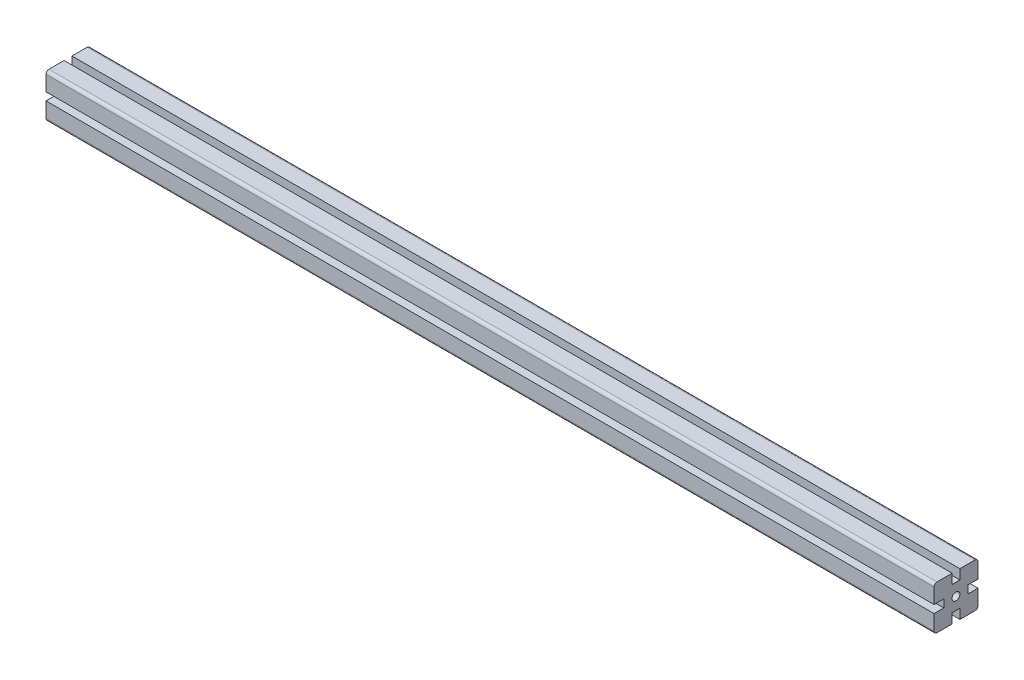
ISO-10303-21;
HEADER;
FILE_DESCRIPTION(('STEP AP214'),'2;1');
FILE_NAME('part.step','',(''),(''),'','','');
FILE_SCHEMA(('AUTOMOTIVE_DESIGN { 1 0 10303 214 1 1 1 1 }'));
ENDSEC;
DATA;
#1=APPLICATION_CONTEXT('core data for automotive mechanical design processes');
#2=APPLICATION_PROTOCOL_DEFINITION('international standard','automotive_design',2000,#1);
#3=PRODUCT_CONTEXT('',#1,'mechanical');
#4=PRODUCT('Part','Part','',(#3));
#5=PRODUCT_RELATED_PRODUCT_CATEGORY('part','',(#4));
#6=PRODUCT_DEFINITION_FORMATION('','',#4);
#7=PRODUCT_DEFINITION_CONTEXT('part definition',#1,'design');
#8=PRODUCT_DEFINITION('design','',#6,#7);
#9=PRODUCT_DEFINITION_SHAPE('','',#8);
#10=(LENGTH_UNIT() NAMED_UNIT(*) SI_UNIT(.MILLI.,.METRE.));
#11=(NAMED_UNIT(*) PLANE_ANGLE_UNIT() SI_UNIT($,.RADIAN.));
#12=(NAMED_UNIT(*) SI_UNIT($,.STERADIAN.) SOLID_ANGLE_UNIT());
#13=UNCERTAINTY_MEASURE_WITH_UNIT(LENGTH_MEASURE(1.E-05),#10,'distance_accuracy_value','');
#14=(GEOMETRIC_REPRESENTATION_CONTEXT(3) GLOBAL_UNCERTAINTY_ASSIGNED_CONTEXT((#13)) GLOBAL_UNIT_ASSIGNED_CONTEXT((#10,
#11,#12)) REPRESENTATION_CONTEXT('',''));
#15=CARTESIAN_POINT('',(0.,0.,0.));
#16=DIRECTION('',(0.,0.,1.));
#17=DIRECTION('',(1.,0.,0.));
#18=AXIS2_PLACEMENT_3D('',#15,#16,#17);
#19=CARTESIAN_POINT('',(92.,-22.5,-22.5));
#20=DIRECTION('',(0.,0.,-1.));
#21=DIRECTION('',(0.,1.,0.));
#22=AXIS2_PLACEMENT_3D('',#19,#20,#21);
#23=PLANE('',#22);
#24=DIRECTION('',(0.,1.,0.));
#25=VECTOR('',#24,1.);
#26=CARTESIAN_POINT('',(1000.,-22.5,-22.5));
#27=LINE('',#26,#25);
#28=CARTESIAN_POINT('',(1000.,-19.5,-22.5));
#29=VERTEX_POINT('',#28);
#30=CARTESIAN_POINT('',(1000.,-4.,-22.5));
#31=VERTEX_POINT('',#30);
#32=EDGE_CURVE('E270',#29,#31,#27,.T.);
#33=ORIENTED_EDGE('',*,*,#32,.F.);
#34=DIRECTION('',(1.,0.,0.));
#35=VECTOR('',#34,1.);
#36=CARTESIAN_POINT('',(92.,-19.5,-22.5));
#37=LINE('',#36,#35);
#38=CARTESIAN_POINT('',(92.,-19.5,-22.5));
#39=VERTEX_POINT('',#38);
#40=EDGE_CURVE('E200',#29,#39,#37,.F.);
#41=ORIENTED_EDGE('',*,*,#40,.T.);
#42=DIRECTION('',(0.,1.,0.));
#43=VECTOR('',#42,1.);
#44=CARTESIAN_POINT('',(92.,-22.5,-22.5));
#45=LINE('',#44,#43);
#46=CARTESIAN_POINT('',(92.,-4.,-22.5));
#47=VERTEX_POINT('',#46);
#48=EDGE_CURVE('E194',#39,#47,#45,.T.);
#49=ORIENTED_EDGE('',*,*,#48,.T.);
#50=DIRECTION('',(1.,0.,0.));
#51=VECTOR('',#50,1.);
#52=CARTESIAN_POINT('',(92.,-4.,-22.5));
#53=LINE('',#52,#51);
#54=EDGE_CURVE('E197',#47,#31,#53,.T.);
#55=ORIENTED_EDGE('',*,*,#54,.T.);
#56=EDGE_LOOP('',(#33,#41,#49,#55));
#57=FACE_BOUND('',#56,.T.);
#58=ADVANCED_FACE('F33',(#57),#23,.T.);
#59=CARTESIAN_POINT('',(92.,-22.5,-4.));
#60=DIRECTION('',(0.,-1.,0.));
#61=DIRECTION('',(0.,0.,-1.));
#62=AXIS2_PLACEMENT_3D('',#59,#60,#61);
#63=PLANE('',#62);
#64=DIRECTION('',(0.,0.,-1.));
#65=VECTOR('',#64,1.);
#66=CARTESIAN_POINT('',(92.,-22.5,-4.));
#67=LINE('',#66,#65);
#68=CARTESIAN_POINT('',(92.,-22.5,-4.));
#69=VERTEX_POINT('',#68);
#70=CARTESIAN_POINT('',(92.,-22.5,-19.5));
#71=VERTEX_POINT('',#70);
#72=EDGE_CURVE('E212',#69,#71,#67,.T.);
#73=ORIENTED_EDGE('',*,*,#72,.T.);
#74=DIRECTION('',(1.,0.,0.));
#75=VECTOR('',#74,1.);
#76=CARTESIAN_POINT('',(92.,-22.5,-19.5));
#77=LINE('',#76,#75);
#78=CARTESIAN_POINT('',(1000.,-22.5,-19.5));
#79=VERTEX_POINT('',#78);
#80=EDGE_CURVE('E376',#71,#79,#77,.T.);
#81=ORIENTED_EDGE('',*,*,#80,.T.);
#82=DIRECTION('',(0.,0.,-1.));
#83=VECTOR('',#82,1.);
#84=CARTESIAN_POINT('',(1000.,-22.5,-4.));
#85=LINE('',#84,#83);
#86=CARTESIAN_POINT('',(1000.,-22.5,-4.));
#87=VERTEX_POINT('',#86);
#88=EDGE_CURVE('E204',#87,#79,#85,.T.);
#89=ORIENTED_EDGE('',*,*,#88,.F.);
#90=DIRECTION('',(1.,0.,0.));
#91=VECTOR('',#90,1.);
#92=CARTESIAN_POINT('',(92.,-22.5,-4.));
#93=LINE('',#92,#91);
#94=EDGE_CURVE('E324',#69,#87,#93,.T.);
#95=ORIENTED_EDGE('',*,*,#94,.F.);
#96=EDGE_LOOP('',(#73,#81,#89,#95));
#97=FACE_BOUND('',#96,.T.);
#98=ADVANCED_FACE('F404',(#97),#63,.T.);
#99=CARTESIAN_POINT('',(92.,-12.5,-4.));
#100=DIRECTION('',(0.,0.,1.));
#101=DIRECTION('',(1.,0.,0.));
#102=AXIS2_PLACEMENT_3D('',#99,#100,#101);
#103=PLANE('',#102);
#104=DIRECTION('',(0.,-1.,0.));
#105=VECTOR('',#104,1.);
#106=CARTESIAN_POINT('',(1000.,-12.5,-4.));
#107=LINE('',#106,#105);
#108=CARTESIAN_POINT('',(1000.,-12.5,-4.));
#109=VERTEX_POINT('',#108);
#110=EDGE_CURVE('E319',#109,#87,#107,.T.);
#111=ORIENTED_EDGE('',*,*,#110,.F.);
#112=DIRECTION('',(1.,0.,0.));
#113=VECTOR('',#112,1.);
#114=CARTESIAN_POINT('',(92.,-12.5,-4.));
#115=LINE('',#114,#113);
#116=CARTESIAN_POINT('',(92.,-12.5,-4.));
#117=VERTEX_POINT('',#116);
#118=EDGE_CURVE('E327',#117,#109,#115,.T.);
#119=ORIENTED_EDGE('',*,*,#118,.F.);
#120=DIRECTION('',(0.,-1.,0.));
#121=VECTOR('',#120,1.);
#122=CARTESIAN_POINT('',(92.,-12.5,-4.));
#123=LINE('',#122,#121);
#124=EDGE_CURVE('E265',#117,#69,#123,.T.);
#125=ORIENTED_EDGE('',*,*,#124,.T.);
#126=ORIENTED_EDGE('',*,*,#94,.T.);
#127=EDGE_LOOP('',(#111,#119,#125,#126));
#128=FACE_BOUND('',#127,.T.);
#129=ADVANCED_FACE('F408',(#128),#103,.T.);
#130=CARTESIAN_POINT('',(92.,-12.5,4.));
#131=DIRECTION('',(0.,-1.,0.));
#132=DIRECTION('',(0.,0.,-1.));
#133=AXIS2_PLACEMENT_3D('',#130,#131,#132);
#134=PLANE('',#133);
#135=DIRECTION('',(0.,0.,-1.));
#136=VECTOR('',#135,1.);
#137=CARTESIAN_POINT('',(1000.,-12.5,4.));
#138=LINE('',#137,#136);
#139=CARTESIAN_POINT('',(1000.,-12.5,4.));
#140=VERTEX_POINT('',#139);
#141=EDGE_CURVE('E316',#140,#109,#138,.T.);
#142=ORIENTED_EDGE('',*,*,#141,.F.);
#143=DIRECTION('',(1.,0.,0.));
#144=VECTOR('',#143,1.);
#145=CARTESIAN_POINT('',(92.,-12.5,4.));
#146=LINE('',#145,#144);
#147=CARTESIAN_POINT('',(92.,-12.5,4.));
#148=VERTEX_POINT('',#147);
#149=EDGE_CURVE('E329',#148,#140,#146,.T.);
#150=ORIENTED_EDGE('',*,*,#149,.F.);
#151=DIRECTION('',(0.,0.,-1.));
#152=VECTOR('',#151,1.);
#153=CARTESIAN_POINT('',(92.,-12.5,4.));
#154=LINE('',#153,#152);
#155=EDGE_CURVE('E262',#148,#117,#154,.T.);
#156=ORIENTED_EDGE('',*,*,#155,.T.);
#157=ORIENTED_EDGE('',*,*,#118,.T.);
#158=EDGE_LOOP('',(#142,#150,#156,#157));
#159=FACE_BOUND('',#158,.T.);
#160=ADVANCED_FACE('F413',(#159),#134,.T.);
#161=CARTESIAN_POINT('',(92.,-22.5,4.));
#162=DIRECTION('',(0.,0.,-1.));
#163=DIRECTION('',(-1.,0.,0.));
#164=AXIS2_PLACEMENT_3D('',#161,#162,#163);
#165=PLANE('',#164);
#166=DIRECTION('',(0.,1.,0.));
#167=VECTOR('',#166,1.);
#168=CARTESIAN_POINT('',(1000.,-22.5,4.));
#169=LINE('',#168,#167);
#170=CARTESIAN_POINT('',(1000.,-22.5,4.));
#171=VERTEX_POINT('',#170);
#172=EDGE_CURVE('E313',#171,#140,#169,.T.);
#173=ORIENTED_EDGE('',*,*,#172,.F.);
#174=DIRECTION('',(1.,0.,0.));
#175=VECTOR('',#174,1.);
#176=CARTESIAN_POINT('',(92.,-22.5,4.));
#177=LINE('',#176,#175);
#178=CARTESIAN_POINT('',(92.,-22.5,4.));
#179=VERTEX_POINT('',#178);
#180=EDGE_CURVE('E331',#179,#171,#177,.T.);
#181=ORIENTED_EDGE('',*,*,#180,.F.);
#182=DIRECTION('',(0.,1.,0.));
#183=VECTOR('',#182,1.);
#184=CARTESIAN_POINT('',(92.,-22.5,4.));
#185=LINE('',#184,#183);
#186=EDGE_CURVE('E259',#179,#148,#185,.T.);
#187=ORIENTED_EDGE('',*,*,#186,.T.);
#188=ORIENTED_EDGE('',*,*,#149,.T.);
#189=EDGE_LOOP('',(#173,#181,#187,#188));
#190=FACE_BOUND('',#189,.T.);
#191=ADVANCED_FACE('F416',(#190),#165,.T.);
#192=CARTESIAN_POINT('',(92.,-22.5,22.5));
#193=DIRECTION('',(0.,-1.,0.));
#194=DIRECTION('',(0.,0.,-1.));
#195=AXIS2_PLACEMENT_3D('',#192,#193,#194);
#196=PLANE('',#195);
#197=DIRECTION('',(0.,0.,-1.));
#198=VECTOR('',#197,1.);
#199=CARTESIAN_POINT('',(1000.,-22.5,22.5));
#200=LINE('',#199,#198);
#201=CARTESIAN_POINT('',(1000.,-22.5,19.5));
#202=VERTEX_POINT('',#201);
#203=EDGE_CURVE('E311',#202,#171,#200,.T.);
#204=ORIENTED_EDGE('',*,*,#203,.F.);
#205=DIRECTION('',(1.,0.,0.));
#206=VECTOR('',#205,1.);
#207=CARTESIAN_POINT('',(92.,-22.5,19.5));
#208=LINE('',#207,#206);
#209=CARTESIAN_POINT('',(92.,-22.5,19.5));
#210=VERTEX_POINT('',#209);
#211=EDGE_CURVE('E367',#202,#210,#208,.F.);
#212=ORIENTED_EDGE('',*,*,#211,.T.);
#213=DIRECTION('',(0.,0.,-1.));
#214=VECTOR('',#213,1.);
#215=CARTESIAN_POINT('',(92.,-22.5,22.5));
#216=LINE('',#215,#214);
#217=EDGE_CURVE('E257',#210,#179,#216,.T.);
#218=ORIENTED_EDGE('',*,*,#217,.T.);
#219=ORIENTED_EDGE('',*,*,#180,.T.);
#220=EDGE_LOOP('',(#204,#212,#218,#219));
#221=FACE_BOUND('',#220,.T.);
#222=ADVANCED_FACE('F628',(#221),#196,.T.);
#223=CARTESIAN_POINT('',(92.,-4.,22.5));
#224=DIRECTION('',(0.,0.,1.));
#225=DIRECTION('',(0.,-1.,0.));
#226=AXIS2_PLACEMENT_3D('',#223,#224,#225);
#227=PLANE('',#226);
#228=DIRECTION('',(0.,-1.,0.));
#229=VECTOR('',#228,1.);
#230=CARTESIAN_POINT('',(92.,-4.,22.5));
#231=LINE('',#230,#229);
#232=CARTESIAN_POINT('',(92.,-4.,22.5));
#233=VERTEX_POINT('',#232);
#234=CARTESIAN_POINT('',(92.,-19.5,22.5));
#235=VERTEX_POINT('',#234);
#236=EDGE_CURVE('E254',#233,#235,#231,.T.);
#237=ORIENTED_EDGE('',*,*,#236,.T.);
#238=DIRECTION('',(1.,0.,0.));
#239=VECTOR('',#238,1.);
#240=CARTESIAN_POINT('',(92.,-19.5,22.5));
#241=LINE('',#240,#239);
#242=CARTESIAN_POINT('',(1000.,-19.5,22.5));
#243=VERTEX_POINT('',#242);
#244=EDGE_CURVE('E326',#235,#243,#241,.T.);
#245=ORIENTED_EDGE('',*,*,#244,.T.);
#246=DIRECTION('',(0.,-1.,0.));
#247=VECTOR('',#246,1.);
#248=CARTESIAN_POINT('',(1000.,-4.,22.5));
#249=LINE('',#248,#247);
#250=CARTESIAN_POINT('',(1000.,-4.,22.5));
#251=VERTEX_POINT('',#250);
#252=EDGE_CURVE('E308',#251,#243,#249,.T.);
#253=ORIENTED_EDGE('',*,*,#252,.F.);
#254=DIRECTION('',(1.,0.,0.));
#255=VECTOR('',#254,1.);
#256=CARTESIAN_POINT('',(92.,-4.,22.5));
#257=LINE('',#256,#255);
#258=EDGE_CURVE('E334',#233,#251,#257,.T.);
#259=ORIENTED_EDGE('',*,*,#258,.F.);
#260=EDGE_LOOP('',(#237,#245,#253,#259));
#261=FACE_BOUND('',#260,.T.);
#262=ADVANCED_FACE('F427',(#261),#227,.T.);
#263=CARTESIAN_POINT('',(92.,-4.,12.5));
#264=DIRECTION('',(0.,1.,0.));
#265=DIRECTION('',(0.,0.,1.));
#266=AXIS2_PLACEMENT_3D('',#263,#264,#265);
#267=PLANE('',#266);
#268=DIRECTION('',(0.,0.,1.));
#269=VECTOR('',#268,1.);
#270=CARTESIAN_POINT('',(1000.,-4.,12.5));
#271=LINE('',#270,#269);
#272=CARTESIAN_POINT('',(1000.,-4.,12.5));
#273=VERTEX_POINT('',#272);
#274=EDGE_CURVE('E305',#273,#251,#271,.T.);
#275=ORIENTED_EDGE('',*,*,#274,.F.);
#276=DIRECTION('',(1.,0.,0.));
#277=VECTOR('',#276,1.);
#278=CARTESIAN_POINT('',(92.,-4.,12.5));
#279=LINE('',#278,#277);
#280=CARTESIAN_POINT('',(92.,-4.,12.5));
#281=VERTEX_POINT('',#280);
#282=EDGE_CURVE('E336',#281,#273,#279,.T.);
#283=ORIENTED_EDGE('',*,*,#282,.F.);
#284=DIRECTION('',(0.,0.,1.));
#285=VECTOR('',#284,1.);
#286=CARTESIAN_POINT('',(92.,-4.,12.5));
#287=LINE('',#286,#285);
#288=EDGE_CURVE('E251',#281,#233,#287,.T.);
#289=ORIENTED_EDGE('',*,*,#288,.T.);
#290=ORIENTED_EDGE('',*,*,#258,.T.);
#291=EDGE_LOOP('',(#275,#283,#289,#290));
#292=FACE_BOUND('',#291,.T.);
#293=ADVANCED_FACE('F432',(#292),#267,.T.);
#294=CARTESIAN_POINT('',(92.,4.,12.5));
#295=DIRECTION('',(0.,0.,1.));
#296=DIRECTION('',(1.,0.,0.));
#297=AXIS2_PLACEMENT_3D('',#294,#295,#296);
#298=PLANE('',#297);
#299=DIRECTION('',(0.,-1.,0.));
#300=VECTOR('',#299,1.);
#301=CARTESIAN_POINT('',(1000.,4.,12.5));
#302=LINE('',#301,#300);
#303=CARTESIAN_POINT('',(1000.,4.,12.5));
#304=VERTEX_POINT('',#303);
#305=EDGE_CURVE('E302',#304,#273,#302,.T.);
#306=ORIENTED_EDGE('',*,*,#305,.F.);
#307=DIRECTION('',(1.,0.,0.));
#308=VECTOR('',#307,1.);
#309=CARTESIAN_POINT('',(92.,4.,12.5));
#310=LINE('',#309,#308);
#311=CARTESIAN_POINT('',(92.,4.,12.5));
#312=VERTEX_POINT('',#311);
#313=EDGE_CURVE('E338',#312,#304,#310,.T.);
#314=ORIENTED_EDGE('',*,*,#313,.F.);
#315=DIRECTION('',(0.,-1.,0.));
#316=VECTOR('',#315,1.);
#317=CARTESIAN_POINT('',(92.,4.,12.5));
#318=LINE('',#317,#316);
#319=EDGE_CURVE('E248',#312,#281,#318,.T.);
#320=ORIENTED_EDGE('',*,*,#319,.T.);
#321=ORIENTED_EDGE('',*,*,#282,.T.);
#322=EDGE_LOOP('',(#306,#314,#320,#321));
#323=FACE_BOUND('',#322,.T.);
#324=ADVANCED_FACE('F437',(#323),#298,.T.);
#325=CARTESIAN_POINT('',(92.,4.,22.5));
#326=DIRECTION('',(0.,-1.,0.));
#327=DIRECTION('',(0.,0.,-1.));
#328=AXIS2_PLACEMENT_3D('',#325,#326,#327);
#329=PLANE('',#328);
#330=DIRECTION('',(0.,0.,-1.));
#331=VECTOR('',#330,1.);
#332=CARTESIAN_POINT('',(1000.,4.,22.5));
#333=LINE('',#332,#331);
#334=CARTESIAN_POINT('',(1000.,4.,22.5));
#335=VERTEX_POINT('',#334);
#336=EDGE_CURVE('E299',#335,#304,#333,.T.);
#337=ORIENTED_EDGE('',*,*,#336,.F.);
#338=DIRECTION('',(1.,0.,0.));
#339=VECTOR('',#338,1.);
#340=CARTESIAN_POINT('',(92.,4.,22.5));
#341=LINE('',#340,#339);
#342=CARTESIAN_POINT('',(92.,4.,22.5));
#343=VERTEX_POINT('',#342);
#344=EDGE_CURVE('E340',#343,#335,#341,.T.);
#345=ORIENTED_EDGE('',*,*,#344,.F.);
#346=DIRECTION('',(0.,0.,-1.));
#347=VECTOR('',#346,1.);
#348=CARTESIAN_POINT('',(92.,4.,22.5));
#349=LINE('',#348,#347);
#350=EDGE_CURVE('E245',#343,#312,#349,.T.);
#351=ORIENTED_EDGE('',*,*,#350,.T.);
#352=ORIENTED_EDGE('',*,*,#313,.T.);
#353=EDGE_LOOP('',(#337,#345,#351,#352));
#354=FACE_BOUND('',#353,.T.);
#355=ADVANCED_FACE('F440',(#354),#329,.T.);
#356=CARTESIAN_POINT('',(92.,22.5,22.5));
#357=DIRECTION('',(0.,0.,1.));
#358=DIRECTION('',(0.,-1.,0.));
#359=AXIS2_PLACEMENT_3D('',#356,#357,#358);
#360=PLANE('',#359);
#361=DIRECTION('',(0.,-1.,0.));
#362=VECTOR('',#361,1.);
#363=CARTESIAN_POINT('',(1000.,22.5,22.5));
#364=LINE('',#363,#362);
#365=CARTESIAN_POINT('',(1000.,19.5,22.5));
#366=VERTEX_POINT('',#365);
#367=EDGE_CURVE('E297',#366,#335,#364,.T.);
#368=ORIENTED_EDGE('',*,*,#367,.F.);
#369=DIRECTION('',(1.,0.,0.));
#370=VECTOR('',#369,1.);
#371=CARTESIAN_POINT('',(92.,19.5,22.5));
#372=LINE('',#371,#370);
#373=CARTESIAN_POINT('',(92.,19.5,22.5));
#374=VERTEX_POINT('',#373);
#375=EDGE_CURVE('E383',#366,#374,#372,.F.);
#376=ORIENTED_EDGE('',*,*,#375,.T.);
#377=DIRECTION('',(0.,-1.,0.));
#378=VECTOR('',#377,1.);
#379=CARTESIAN_POINT('',(92.,22.5,22.5));
#380=LINE('',#379,#378);
#381=EDGE_CURVE('E243',#374,#343,#380,.T.);
#382=ORIENTED_EDGE('',*,*,#381,.T.);
#383=ORIENTED_EDGE('',*,*,#344,.T.);
#384=EDGE_LOOP('',(#368,#376,#382,#383));
#385=FACE_BOUND('',#384,.T.);
#386=ADVANCED_FACE('F592',(#385),#360,.T.);
#387=CARTESIAN_POINT('',(92.,22.5,4.));
#388=DIRECTION('',(0.,1.,0.));
#389=DIRECTION('',(0.,0.,1.));
#390=AXIS2_PLACEMENT_3D('',#387,#388,#389);
#391=PLANE('',#390);
#392=DIRECTION('',(0.,0.,1.));
#393=VECTOR('',#392,1.);
#394=CARTESIAN_POINT('',(92.,22.5,4.));
#395=LINE('',#394,#393);
#396=CARTESIAN_POINT('',(92.,22.5,4.));
#397=VERTEX_POINT('',#396);
#398=CARTESIAN_POINT('',(92.,22.5,19.5));
#399=VERTEX_POINT('',#398);
#400=EDGE_CURVE('E240',#397,#399,#395,.T.);
#401=ORIENTED_EDGE('',*,*,#400,.T.);
#402=DIRECTION('',(1.,0.,0.));
#403=VECTOR('',#402,1.);
#404=CARTESIAN_POINT('',(92.,22.5,19.5));
#405=LINE('',#404,#403);
#406=CARTESIAN_POINT('',(1000.,22.5,19.5));
#407=VERTEX_POINT('',#406);
#408=EDGE_CURVE('E380',#399,#407,#405,.T.);
#409=ORIENTED_EDGE('',*,*,#408,.T.);
#410=DIRECTION('',(0.,0.,1.));
#411=VECTOR('',#410,1.);
#412=CARTESIAN_POINT('',(1000.,22.5,4.));
#413=LINE('',#412,#411);
#414=CARTESIAN_POINT('',(1000.,22.5,4.));
#415=VERTEX_POINT('',#414);
#416=EDGE_CURVE('E294',#415,#407,#413,.T.);
#417=ORIENTED_EDGE('',*,*,#416,.F.);
#418=DIRECTION('',(1.,0.,0.));
#419=VECTOR('',#418,1.);
#420=CARTESIAN_POINT('',(92.,22.5,4.));
#421=LINE('',#420,#419);
#422=EDGE_CURVE('E343',#397,#415,#421,.T.);
#423=ORIENTED_EDGE('',*,*,#422,.F.);
#424=EDGE_LOOP('',(#401,#409,#417,#423));
#425=FACE_BOUND('',#424,.T.);
#426=ADVANCED_FACE('F452',(#425),#391,.T.);
#427=CARTESIAN_POINT('',(92.,12.5,4.));
#428=DIRECTION('',(0.,0.,-1.));
#429=DIRECTION('',(-1.,0.,0.));
#430=AXIS2_PLACEMENT_3D('',#427,#428,#429);
#431=PLANE('',#430);
#432=DIRECTION('',(0.,1.,0.));
#433=VECTOR('',#432,1.);
#434=CARTESIAN_POINT('',(1000.,12.5,4.));
#435=LINE('',#434,#433);
#436=CARTESIAN_POINT('',(1000.,12.5,4.));
#437=VERTEX_POINT('',#436);
#438=EDGE_CURVE('E291',#437,#415,#435,.T.);
#439=ORIENTED_EDGE('',*,*,#438,.F.);
#440=DIRECTION('',(1.,0.,0.));
#441=VECTOR('',#440,1.);
#442=CARTESIAN_POINT('',(92.,12.5,4.));
#443=LINE('',#442,#441);
#444=CARTESIAN_POINT('',(92.,12.5,4.));
#445=VERTEX_POINT('',#444);
#446=EDGE_CURVE('E345',#445,#437,#443,.T.);
#447=ORIENTED_EDGE('',*,*,#446,.F.);
#448=DIRECTION('',(0.,1.,0.));
#449=VECTOR('',#448,1.);
#450=CARTESIAN_POINT('',(92.,12.5,4.));
#451=LINE('',#450,#449);
#452=EDGE_CURVE('E237',#445,#397,#451,.T.);
#453=ORIENTED_EDGE('',*,*,#452,.T.);
#454=ORIENTED_EDGE('',*,*,#422,.T.);
#455=EDGE_LOOP('',(#439,#447,#453,#454));
#456=FACE_BOUND('',#455,.T.);
#457=ADVANCED_FACE('F457',(#456),#431,.T.);
#458=CARTESIAN_POINT('',(92.,12.5,-4.));
#459=DIRECTION('',(0.,1.,0.));
#460=DIRECTION('',(0.,0.,1.));
#461=AXIS2_PLACEMENT_3D('',#458,#459,#460);
#462=PLANE('',#461);
#463=DIRECTION('',(0.,0.,1.));
#464=VECTOR('',#463,1.);
#465=CARTESIAN_POINT('',(1000.,12.5,-4.));
#466=LINE('',#465,#464);
#467=CARTESIAN_POINT('',(1000.,12.5,-4.));
#468=VERTEX_POINT('',#467);
#469=EDGE_CURVE('E288',#468,#437,#466,.T.);
#470=ORIENTED_EDGE('',*,*,#469,.F.);
#471=DIRECTION('',(1.,0.,0.));
#472=VECTOR('',#471,1.);
#473=CARTESIAN_POINT('',(92.,12.5,-4.));
#474=LINE('',#473,#472);
#475=CARTESIAN_POINT('',(92.,12.5,-4.));
#476=VERTEX_POINT('',#475);
#477=EDGE_CURVE('E347',#476,#468,#474,.T.);
#478=ORIENTED_EDGE('',*,*,#477,.F.);
#479=DIRECTION('',(0.,0.,1.));
#480=VECTOR('',#479,1.);
#481=CARTESIAN_POINT('',(92.,12.5,-4.));
#482=LINE('',#481,#480);
#483=EDGE_CURVE('E234',#476,#445,#482,.T.);
#484=ORIENTED_EDGE('',*,*,#483,.T.);
#485=ORIENTED_EDGE('',*,*,#446,.T.);
#486=EDGE_LOOP('',(#470,#478,#484,#485));
#487=FACE_BOUND('',#486,.T.);
#488=ADVANCED_FACE('F462',(#487),#462,.T.);
#489=CARTESIAN_POINT('',(92.,22.5,-4.));
#490=DIRECTION('',(0.,0.,1.));
#491=DIRECTION('',(1.,0.,0.));
#492=AXIS2_PLACEMENT_3D('',#489,#490,#491);
#493=PLANE('',#492);
#494=DIRECTION('',(0.,-1.,0.));
#495=VECTOR('',#494,1.);
#496=CARTESIAN_POINT('',(1000.,22.5,-4.));
#497=LINE('',#496,#495);
#498=CARTESIAN_POINT('',(1000.,22.5,-4.));
#499=VERTEX_POINT('',#498);
#500=EDGE_CURVE('E285',#499,#468,#497,.T.);
#501=ORIENTED_EDGE('',*,*,#500,.F.);
#502=DIRECTION('',(1.,0.,0.));
#503=VECTOR('',#502,1.);
#504=CARTESIAN_POINT('',(92.,22.5,-4.));
#505=LINE('',#504,#503);
#506=CARTESIAN_POINT('',(92.,22.5,-4.));
#507=VERTEX_POINT('',#506);
#508=EDGE_CURVE('E349',#507,#499,#505,.T.);
#509=ORIENTED_EDGE('',*,*,#508,.F.);
#510=DIRECTION('',(0.,-1.,0.));
#511=VECTOR('',#510,1.);
#512=CARTESIAN_POINT('',(92.,22.5,-4.));
#513=LINE('',#512,#511);
#514=EDGE_CURVE('E231',#507,#476,#513,.T.);
#515=ORIENTED_EDGE('',*,*,#514,.T.);
#516=ORIENTED_EDGE('',*,*,#477,.T.);
#517=EDGE_LOOP('',(#501,#509,#515,#516));
#518=FACE_BOUND('',#517,.T.);
#519=ADVANCED_FACE('F465',(#518),#493,.T.);
#520=CARTESIAN_POINT('',(92.,22.5,-22.5));
#521=DIRECTION('',(0.,1.,0.));
#522=DIRECTION('',(0.,0.,1.));
#523=AXIS2_PLACEMENT_3D('',#520,#521,#522);
#524=PLANE('',#523);
#525=DIRECTION('',(0.,0.,1.));
#526=VECTOR('',#525,1.);
#527=CARTESIAN_POINT('',(1000.,22.5,-22.5));
#528=LINE('',#527,#526);
#529=CARTESIAN_POINT('',(1000.,22.5,-19.5));
#530=VERTEX_POINT('',#529);
#531=EDGE_CURVE('E283',#530,#499,#528,.T.);
#532=ORIENTED_EDGE('',*,*,#531,.F.);
#533=DIRECTION('',(1.,0.,0.));
#534=VECTOR('',#533,1.);
#535=CARTESIAN_POINT('',(92.,22.5,-19.5));
#536=LINE('',#535,#534);
#537=CARTESIAN_POINT('',(92.,22.5,-19.5));
#538=VERTEX_POINT('',#537);
#539=EDGE_CURVE('E11',#530,#538,#536,.F.);
#540=ORIENTED_EDGE('',*,*,#539,.T.);
#541=DIRECTION('',(0.,0.,1.));
#542=VECTOR('',#541,1.);
#543=CARTESIAN_POINT('',(92.,22.5,-22.5));
#544=LINE('',#543,#542);
#545=EDGE_CURVE('E229',#538,#507,#544,.T.);
#546=ORIENTED_EDGE('',*,*,#545,.T.);
#547=ORIENTED_EDGE('',*,*,#508,.T.);
#548=EDGE_LOOP('',(#532,#540,#546,#547));
#549=FACE_BOUND('',#548,.T.);
#550=ADVANCED_FACE('F556',(#549),#524,.T.);
#551=CARTESIAN_POINT('',(92.,4.,-22.5));
#552=DIRECTION('',(0.,0.,-1.));
#553=DIRECTION('',(0.,1.,0.));
#554=AXIS2_PLACEMENT_3D('',#551,#552,#553);
#555=PLANE('',#554);
#556=DIRECTION('',(0.,1.,0.));
#557=VECTOR('',#556,1.);
#558=CARTESIAN_POINT('',(92.,4.,-22.5));
#559=LINE('',#558,#557);
#560=CARTESIAN_POINT('',(92.,4.,-22.5));
#561=VERTEX_POINT('',#560);
#562=CARTESIAN_POINT('',(92.,19.5,-22.5));
#563=VERTEX_POINT('',#562);
#564=EDGE_CURVE('E227',#561,#563,#559,.T.);
#565=ORIENTED_EDGE('',*,*,#564,.T.);
#566=DIRECTION('',(1.,0.,0.));
#567=VECTOR('',#566,1.);
#568=CARTESIAN_POINT('',(92.,19.5,-22.5));
#569=LINE('',#568,#567);
#570=CARTESIAN_POINT('',(1000.,19.5,-22.5));
#571=VERTEX_POINT('',#570);
#572=EDGE_CURVE('E41',#563,#571,#569,.T.);
#573=ORIENTED_EDGE('',*,*,#572,.T.);
#574=DIRECTION('',(0.,1.,0.));
#575=VECTOR('',#574,1.);
#576=CARTESIAN_POINT('',(1000.,4.,-22.5));
#577=LINE('',#576,#575);
#578=CARTESIAN_POINT('',(1000.,4.,-22.5));
#579=VERTEX_POINT('',#578);
#580=EDGE_CURVE('E280',#579,#571,#577,.T.);
#581=ORIENTED_EDGE('',*,*,#580,.F.);
#582=DIRECTION('',(1.,0.,0.));
#583=VECTOR('',#582,1.);
#584=CARTESIAN_POINT('',(92.,4.,-22.5));
#585=LINE('',#584,#583);
#586=EDGE_CURVE('E352',#561,#579,#585,.T.);
#587=ORIENTED_EDGE('',*,*,#586,.F.);
#588=EDGE_LOOP('',(#565,#573,#581,#587));
#589=FACE_BOUND('',#588,.T.);
#590=ADVANCED_FACE('F388',(#589),#555,.T.);
#591=CARTESIAN_POINT('',(92.,4.,-12.5));
#592=DIRECTION('',(0.,-1.,0.));
#593=DIRECTION('',(0.,0.,-1.));
#594=AXIS2_PLACEMENT_3D('',#591,#592,#593);
#595=PLANE('',#594);
#596=DIRECTION('',(0.,0.,-1.));
#597=VECTOR('',#596,1.);
#598=CARTESIAN_POINT('',(1000.,4.,-12.5));
#599=LINE('',#598,#597);
#600=CARTESIAN_POINT('',(1000.,4.,-12.5));
#601=VERTEX_POINT('',#600);
#602=EDGE_CURVE('E277',#601,#579,#599,.T.);
#603=ORIENTED_EDGE('',*,*,#602,.F.);
#604=DIRECTION('',(1.,0.,0.));
#605=VECTOR('',#604,1.);
#606=CARTESIAN_POINT('',(92.,4.,-12.5));
#607=LINE('',#606,#605);
#608=CARTESIAN_POINT('',(92.,4.,-12.5));
#609=VERTEX_POINT('',#608);
#610=EDGE_CURVE('E354',#609,#601,#607,.T.);
#611=ORIENTED_EDGE('',*,*,#610,.F.);
#612=DIRECTION('',(0.,0.,-1.));
#613=VECTOR('',#612,1.);
#614=CARTESIAN_POINT('',(92.,4.,-12.5));
#615=LINE('',#614,#613);
#616=EDGE_CURVE('E221',#609,#561,#615,.T.);
#617=ORIENTED_EDGE('',*,*,#616,.T.);
#618=ORIENTED_EDGE('',*,*,#586,.T.);
#619=EDGE_LOOP('',(#603,#611,#617,#618));
#620=FACE_BOUND('',#619,.T.);
#621=ADVANCED_FACE('F395',(#620),#595,.T.);
#622=CARTESIAN_POINT('',(92.,-4.,-12.5));
#623=DIRECTION('',(0.,0.,-1.));
#624=DIRECTION('',(-1.,0.,0.));
#625=AXIS2_PLACEMENT_3D('',#622,#623,#624);
#626=PLANE('',#625);
#627=DIRECTION('',(0.,1.,0.));
#628=VECTOR('',#627,1.);
#629=CARTESIAN_POINT('',(1000.,-4.,-12.5));
#630=LINE('',#629,#628);
#631=CARTESIAN_POINT('',(1000.,-4.,-12.5));
#632=VERTEX_POINT('',#631);
#633=EDGE_CURVE('E274',#632,#601,#630,.T.);
#634=ORIENTED_EDGE('',*,*,#633,.F.);
#635=DIRECTION('',(1.,0.,0.));
#636=VECTOR('',#635,1.);
#637=CARTESIAN_POINT('',(92.,-4.,-12.5));
#638=LINE('',#637,#636);
#639=CARTESIAN_POINT('',(92.,-4.,-12.5));
#640=VERTEX_POINT('',#639);
#641=EDGE_CURVE('E211',#640,#632,#638,.T.);
#642=ORIENTED_EDGE('',*,*,#641,.F.);
#643=DIRECTION('',(0.,1.,0.));
#644=VECTOR('',#643,1.);
#645=CARTESIAN_POINT('',(92.,-4.,-12.5));
#646=LINE('',#645,#644);
#647=EDGE_CURVE('E219',#640,#609,#646,.T.);
#648=ORIENTED_EDGE('',*,*,#647,.T.);
#649=ORIENTED_EDGE('',*,*,#610,.T.);
#650=EDGE_LOOP('',(#634,#642,#648,#649));
#651=FACE_BOUND('',#650,.T.);
#652=ADVANCED_FACE('F397',(#651),#626,.T.);
#653=CARTESIAN_POINT('',(92.,-4.,-22.5));
#654=DIRECTION('',(0.,1.,0.));
#655=DIRECTION('',(0.,0.,1.));
#656=AXIS2_PLACEMENT_3D('',#653,#654,#655);
#657=PLANE('',#656);
#658=DIRECTION('',(0.,0.,1.));
#659=VECTOR('',#658,1.);
#660=CARTESIAN_POINT('',(1000.,-4.,-22.5));
#661=LINE('',#660,#659);
#662=EDGE_CURVE('E210',#31,#632,#661,.T.);
#663=ORIENTED_EDGE('',*,*,#662,.F.);
#664=ORIENTED_EDGE('',*,*,#54,.F.);
#665=DIRECTION('',(0.,0.,1.));
#666=VECTOR('',#665,1.);
#667=CARTESIAN_POINT('',(92.,-4.,-22.5));
#668=LINE('',#667,#666);
#669=EDGE_CURVE('E203',#47,#640,#668,.T.);
#670=ORIENTED_EDGE('',*,*,#669,.T.);
#671=ORIENTED_EDGE('',*,*,#641,.T.);
#672=EDGE_LOOP('',(#663,#664,#670,#671));
#673=FACE_BOUND('',#672,.T.);
#674=ADVANCED_FACE('F208',(#673),#657,.T.);
#675=CARTESIAN_POINT('',(92.,0.,0.));
#676=DIRECTION('',(1.,0.,0.));
#677=DIRECTION('',(0.,0.,-1.));
#678=AXIS2_PLACEMENT_3D('',#675,#676,#677);
#679=PLANE('',#678);
#680=CARTESIAN_POINT('',(92.,0.,0.));
#681=DIRECTION('',(1.,0.,0.));
#682=DIRECTION('',(0.,0.,1.));
#683=AXIS2_PLACEMENT_3D('',#680,#681,#682);
#684=CIRCLE('',#683,4.);
#685=CARTESIAN_POINT('',(92.,0.,4.));
#686=VERTEX_POINT('',#685);
#687=EDGE_CURVE('E272',#686,#686,#684,.T.);
#688=ORIENTED_EDGE('',*,*,#687,.T.);
#689=EDGE_LOOP('',(#688));
#690=FACE_BOUND('',#689,.T.);
#691=ORIENTED_EDGE('',*,*,#217,.F.);
#692=CARTESIAN_POINT('',(92.,-19.5,19.5));
#693=DIRECTION('',(1.,0.,0.));
#694=DIRECTION('',(0.,0.,-1.));
#695=AXIS2_PLACEMENT_3D('',#692,#693,#694);
#696=CIRCLE('',#695,3.);
#697=EDGE_CURVE('E374',#210,#235,#696,.F.);
#698=ORIENTED_EDGE('',*,*,#697,.T.);
#699=ORIENTED_EDGE('',*,*,#236,.F.);
#700=ORIENTED_EDGE('',*,*,#288,.F.);
#701=ORIENTED_EDGE('',*,*,#319,.F.);
#702=ORIENTED_EDGE('',*,*,#350,.F.);
#703=ORIENTED_EDGE('',*,*,#381,.F.);
#704=CARTESIAN_POINT('',(92.,19.5,19.5));
#705=DIRECTION('',(1.,0.,0.));
#706=DIRECTION('',(0.,0.,-1.));
#707=AXIS2_PLACEMENT_3D('',#704,#705,#706);
#708=CIRCLE('',#707,3.);
#709=EDGE_CURVE('E370',#374,#399,#708,.F.);
#710=ORIENTED_EDGE('',*,*,#709,.T.);
#711=ORIENTED_EDGE('',*,*,#400,.F.);
#712=ORIENTED_EDGE('',*,*,#452,.F.);
#713=ORIENTED_EDGE('',*,*,#483,.F.);
#714=ORIENTED_EDGE('',*,*,#514,.F.);
#715=ORIENTED_EDGE('',*,*,#545,.F.);
#716=CARTESIAN_POINT('',(92.,19.5,-19.5));
#717=DIRECTION('',(1.,0.,0.));
#718=DIRECTION('',(0.,0.,-1.));
#719=AXIS2_PLACEMENT_3D('',#716,#717,#718);
#720=CIRCLE('',#719,3.);
#721=EDGE_CURVE('E48',#538,#563,#720,.F.);
#722=ORIENTED_EDGE('',*,*,#721,.T.);
#723=ORIENTED_EDGE('',*,*,#564,.F.);
#724=ORIENTED_EDGE('',*,*,#616,.F.);
#725=ORIENTED_EDGE('',*,*,#647,.F.);
#726=ORIENTED_EDGE('',*,*,#669,.F.);
#727=ORIENTED_EDGE('',*,*,#48,.F.);
#728=CARTESIAN_POINT('',(92.,-19.5,-19.5));
#729=DIRECTION('',(1.,0.,0.));
#730=DIRECTION('',(0.,0.,-1.));
#731=AXIS2_PLACEMENT_3D('',#728,#729,#730);
#732=CIRCLE('',#731,3.);
#733=EDGE_CURVE('E372',#39,#71,#732,.F.);
#734=ORIENTED_EDGE('',*,*,#733,.T.);
#735=ORIENTED_EDGE('',*,*,#72,.F.);
#736=ORIENTED_EDGE('',*,*,#124,.F.);
#737=ORIENTED_EDGE('',*,*,#155,.F.);
#738=ORIENTED_EDGE('',*,*,#186,.F.);
#739=EDGE_LOOP('',(#691,#698,#699,#700,#701,#702,#703,#710,#711,#712,#713,#714,#715,#722,#723,
#724,#725,#726,#727,#734,#735,#736,#737,#738));
#740=FACE_BOUND('',#739,.T.);
#741=ADVANCED_FACE('F216',(#690,#740),#679,.F.);
#742=CARTESIAN_POINT('',(1000.,0.,0.));
#743=DIRECTION('',(1.,0.,0.));
#744=DIRECTION('',(0.,0.,-1.));
#745=AXIS2_PLACEMENT_3D('',#742,#743,#744);
#746=PLANE('',#745);
#747=CARTESIAN_POINT('',(1000.,0.,0.));
#748=DIRECTION('',(1.,0.,0.));
#749=DIRECTION('',(0.,0.,1.));
#750=AXIS2_PLACEMENT_3D('',#747,#748,#749);
#751=CIRCLE('',#750,4.);
#752=CARTESIAN_POINT('',(1000.,0.,4.));
#753=VERTEX_POINT('',#752);
#754=EDGE_CURVE('E690',#753,#753,#751,.T.);
#755=ORIENTED_EDGE('',*,*,#754,.F.);
#756=EDGE_LOOP('',(#755));
#757=FACE_BOUND('',#756,.T.);
#758=ORIENTED_EDGE('',*,*,#252,.T.);
#759=CARTESIAN_POINT('',(1000.,-19.5,19.5));
#760=DIRECTION('',(1.,0.,0.));
#761=DIRECTION('',(0.,0.,-1.));
#762=AXIS2_PLACEMENT_3D('',#759,#760,#761);
#763=CIRCLE('',#762,3.);
#764=EDGE_CURVE('E365',#243,#202,#763,.T.);
#765=ORIENTED_EDGE('',*,*,#764,.T.);
#766=ORIENTED_EDGE('',*,*,#203,.T.);
#767=ORIENTED_EDGE('',*,*,#172,.T.);
#768=ORIENTED_EDGE('',*,*,#141,.T.);
#769=ORIENTED_EDGE('',*,*,#110,.T.);
#770=ORIENTED_EDGE('',*,*,#88,.T.);
#771=CARTESIAN_POINT('',(1000.,-19.5,-19.5));
#772=DIRECTION('',(1.,0.,0.));
#773=DIRECTION('',(0.,0.,-1.));
#774=AXIS2_PLACEMENT_3D('',#771,#772,#773);
#775=CIRCLE('',#774,3.);
#776=EDGE_CURVE('E363',#79,#29,#775,.T.);
#777=ORIENTED_EDGE('',*,*,#776,.T.);
#778=ORIENTED_EDGE('',*,*,#32,.T.);
#779=ORIENTED_EDGE('',*,*,#662,.T.);
#780=ORIENTED_EDGE('',*,*,#633,.T.);
#781=ORIENTED_EDGE('',*,*,#602,.T.);
#782=ORIENTED_EDGE('',*,*,#580,.T.);
#783=CARTESIAN_POINT('',(1000.,19.5,-19.5));
#784=DIRECTION('',(1.,0.,0.));
#785=DIRECTION('',(0.,0.,-1.));
#786=AXIS2_PLACEMENT_3D('',#783,#784,#785);
#787=CIRCLE('',#786,3.);
#788=EDGE_CURVE('E359',#571,#530,#787,.T.);
#789=ORIENTED_EDGE('',*,*,#788,.T.);
#790=ORIENTED_EDGE('',*,*,#531,.T.);
#791=ORIENTED_EDGE('',*,*,#500,.T.);
#792=ORIENTED_EDGE('',*,*,#469,.T.);
#793=ORIENTED_EDGE('',*,*,#438,.T.);
#794=ORIENTED_EDGE('',*,*,#416,.T.);
#795=CARTESIAN_POINT('',(1000.,19.5,19.5));
#796=DIRECTION('',(1.,0.,0.));
#797=DIRECTION('',(0.,0.,-1.));
#798=AXIS2_PLACEMENT_3D('',#795,#796,#797);
#799=CIRCLE('',#798,3.);
#800=EDGE_CURVE('E361',#407,#366,#799,.T.);
#801=ORIENTED_EDGE('',*,*,#800,.T.);
#802=ORIENTED_EDGE('',*,*,#367,.T.);
#803=ORIENTED_EDGE('',*,*,#336,.T.);
#804=ORIENTED_EDGE('',*,*,#305,.T.);
#805=ORIENTED_EDGE('',*,*,#274,.T.);
#806=EDGE_LOOP('',(#758,#765,#766,#767,#768,#769,#770,#777,#778,#779,#780,#781,#782,#789,#790,
#791,#792,#793,#794,#801,#802,#803,#804,#805));
#807=FACE_BOUND('',#806,.T.);
#808=ADVANCED_FACE('F391',(#757,#807),#746,.T.);
#809=CARTESIAN_POINT('',(92.,0.,0.));
#810=DIRECTION('',(1.,0.,0.));
#811=DIRECTION('',(0.,0.,-1.));
#812=AXIS2_PLACEMENT_3D('',#809,#810,#811);
#813=CYLINDRICAL_SURFACE('',#812,4.);
#814=ORIENTED_EDGE('',*,*,#687,.F.);
#815=EDGE_LOOP('',(#814));
#816=FACE_BOUND('',#815,.T.);
#817=ORIENTED_EDGE('',*,*,#754,.T.);
#818=EDGE_LOOP('',(#817));
#819=FACE_BOUND('',#818,.T.);
#820=ADVANCED_FACE('F482',(#816,#819),#813,.F.);
#821=CARTESIAN_POINT('',(92.,-19.5,19.5));
#822=DIRECTION('',(1.,0.,0.));
#823=DIRECTION('',(0.,0.,-1.));
#824=AXIS2_PLACEMENT_3D('',#821,#822,#823);
#825=CYLINDRICAL_SURFACE('',#824,3.);
#826=ORIENTED_EDGE('',*,*,#697,.F.);
#827=ORIENTED_EDGE('',*,*,#211,.F.);
#828=ORIENTED_EDGE('',*,*,#764,.F.);
#829=ORIENTED_EDGE('',*,*,#244,.F.);
#830=EDGE_LOOP('',(#826,#827,#828,#829));
#831=FACE_BOUND('',#830,.T.);
#832=ADVANCED_FACE('F424',(#831),#825,.T.);
#833=CARTESIAN_POINT('',(92.,-19.5,-19.5));
#834=DIRECTION('',(1.,0.,0.));
#835=DIRECTION('',(0.,0.,-1.));
#836=AXIS2_PLACEMENT_3D('',#833,#834,#835);
#837=CYLINDRICAL_SURFACE('',#836,3.);
#838=ORIENTED_EDGE('',*,*,#733,.F.);
#839=ORIENTED_EDGE('',*,*,#40,.F.);
#840=ORIENTED_EDGE('',*,*,#776,.F.);
#841=ORIENTED_EDGE('',*,*,#80,.F.);
#842=EDGE_LOOP('',(#838,#839,#840,#841));
#843=FACE_BOUND('',#842,.T.);
#844=ADVANCED_FACE('F399',(#843),#837,.T.);
#845=CARTESIAN_POINT('',(92.,19.5,19.5));
#846=DIRECTION('',(1.,0.,0.));
#847=DIRECTION('',(0.,0.,-1.));
#848=AXIS2_PLACEMENT_3D('',#845,#846,#847);
#849=CYLINDRICAL_SURFACE('',#848,3.);
#850=ORIENTED_EDGE('',*,*,#709,.F.);
#851=ORIENTED_EDGE('',*,*,#375,.F.);
#852=ORIENTED_EDGE('',*,*,#800,.F.);
#853=ORIENTED_EDGE('',*,*,#408,.F.);
#854=EDGE_LOOP('',(#850,#851,#852,#853));
#855=FACE_BOUND('',#854,.T.);
#856=ADVANCED_FACE('F449',(#855),#849,.T.);
#857=CARTESIAN_POINT('',(92.,19.5,-19.5));
#858=DIRECTION('',(1.,0.,0.));
#859=DIRECTION('',(0.,0.,-1.));
#860=AXIS2_PLACEMENT_3D('',#857,#858,#859);
#861=CYLINDRICAL_SURFACE('',#860,3.);
#862=ORIENTED_EDGE('',*,*,#721,.F.);
#863=ORIENTED_EDGE('',*,*,#539,.F.);
#864=ORIENTED_EDGE('',*,*,#788,.F.);
#865=ORIENTED_EDGE('',*,*,#572,.F.);
#866=EDGE_LOOP('',(#862,#863,#864,#865));
#867=FACE_BOUND('',#866,.T.);
#868=ADVANCED_FACE('F35',(#867),#861,.T.);
#869=CLOSED_SHELL('',(#58,#98,#129,#160,#191,#222,#262,#293,#324,#355,#386,#426,#457,#488,#519,
#550,#590,#621,#652,#674,#741,#808,#820,#832,#844,#856,#868));
#870=MANIFOLD_SOLID_BREP('B2',#869);
#871=ADVANCED_BREP_SHAPE_REPRESENTATION('',(#18,#870),#14);
#872=SHAPE_DEFINITION_REPRESENTATION(#9,#871);
ENDSEC;
END-ISO-10303-21;
